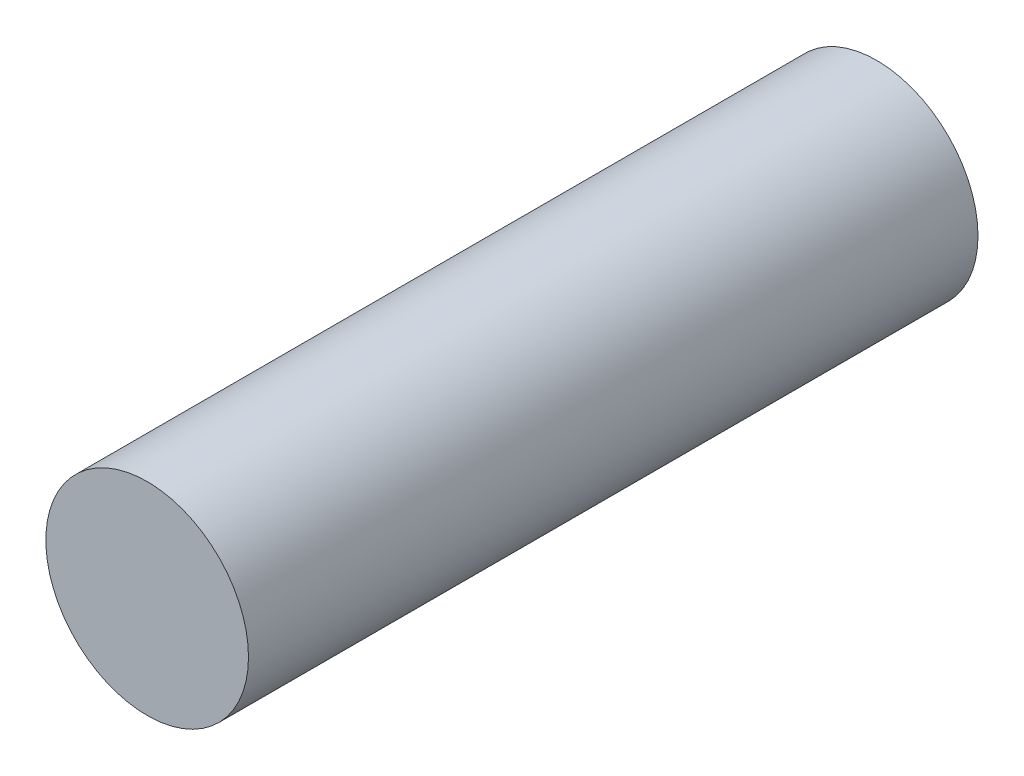
ISO-10303-21;
HEADER;
FILE_DESCRIPTION(('STEP AP214'),'2;1');
FILE_NAME('part.step','',(''),(''),'','','');
FILE_SCHEMA(('AUTOMOTIVE_DESIGN { 1 0 10303 214 1 1 1 1 }'));
ENDSEC;
DATA;
#1=APPLICATION_CONTEXT('core data for automotive mechanical design processes');
#2=APPLICATION_PROTOCOL_DEFINITION('international standard','automotive_design',2000,#1);
#3=PRODUCT_CONTEXT('',#1,'mechanical');
#4=PRODUCT('Part','Part','',(#3));
#5=PRODUCT_RELATED_PRODUCT_CATEGORY('part','',(#4));
#6=PRODUCT_DEFINITION_FORMATION('','',#4);
#7=PRODUCT_DEFINITION_CONTEXT('part definition',#1,'design');
#8=PRODUCT_DEFINITION('design','',#6,#7);
#9=PRODUCT_DEFINITION_SHAPE('','',#8);
#10=(LENGTH_UNIT() NAMED_UNIT(*) SI_UNIT(.MILLI.,.METRE.));
#11=(NAMED_UNIT(*) PLANE_ANGLE_UNIT() SI_UNIT($,.RADIAN.));
#12=(NAMED_UNIT(*) SI_UNIT($,.STERADIAN.) SOLID_ANGLE_UNIT());
#13=UNCERTAINTY_MEASURE_WITH_UNIT(LENGTH_MEASURE(1.E-05),#10,'distance_accuracy_value','');
#14=(GEOMETRIC_REPRESENTATION_CONTEXT(3) GLOBAL_UNCERTAINTY_ASSIGNED_CONTEXT((#13)) GLOBAL_UNIT_ASSIGNED_CONTEXT((#10,
#11,#12)) REPRESENTATION_CONTEXT('',''));
#15=CARTESIAN_POINT('',(0.,0.,0.));
#16=DIRECTION('',(0.,0.,1.));
#17=DIRECTION('',(1.,0.,0.));
#18=AXIS2_PLACEMENT_3D('',#15,#16,#17);
#19=CARTESIAN_POINT('',(0.,0.,9.));
#20=DIRECTION('',(0.,0.,-1.));
#21=DIRECTION('',(-1.,0.,0.));
#22=AXIS2_PLACEMENT_3D('',#19,#20,#21);
#23=CYLINDRICAL_SURFACE('',#22,1.25);
#24=CARTESIAN_POINT('',(0.,0.,9.));
#25=DIRECTION('',(0.,0.,1.));
#26=DIRECTION('',(1.,0.,0.));
#27=AXIS2_PLACEMENT_3D('',#24,#25,#26);
#28=CIRCLE('',#27,1.25);
#29=CARTESIAN_POINT('',(1.25,0.,9.));
#30=VERTEX_POINT('',#29);
#31=EDGE_CURVE('E10',#30,#30,#28,.T.);
#32=ORIENTED_EDGE('',*,*,#31,.F.);
#33=EDGE_LOOP('',(#32));
#34=FACE_BOUND('',#33,.T.);
#35=CARTESIAN_POINT('',(0.,0.,0.));
#36=DIRECTION('',(0.,0.,1.));
#37=DIRECTION('',(1.,0.,0.));
#38=AXIS2_PLACEMENT_3D('',#35,#36,#37);
#39=CIRCLE('',#38,1.25);
#40=CARTESIAN_POINT('',(1.25,0.,0.));
#41=VERTEX_POINT('',#40);
#42=EDGE_CURVE('E33',#41,#41,#39,.T.);
#43=ORIENTED_EDGE('',*,*,#42,.T.);
#44=EDGE_LOOP('',(#43));
#45=FACE_BOUND('',#44,.T.);
#46=ADVANCED_FACE('F30',(#34,#45),#23,.T.);
#47=CARTESIAN_POINT('',(0.,0.,9.));
#48=DIRECTION('',(0.,0.,1.));
#49=DIRECTION('',(1.,0.,0.));
#50=AXIS2_PLACEMENT_3D('',#47,#48,#49);
#51=PLANE('',#50);
#52=ORIENTED_EDGE('',*,*,#31,.T.);
#53=EDGE_LOOP('',(#52));
#54=FACE_BOUND('',#53,.T.);
#55=ADVANCED_FACE('F45',(#54),#51,.T.);
#56=CARTESIAN_POINT('',(0.,0.,0.));
#57=DIRECTION('',(0.,0.,1.));
#58=DIRECTION('',(1.,0.,0.));
#59=AXIS2_PLACEMENT_3D('',#56,#57,#58);
#60=PLANE('',#59);
#61=ORIENTED_EDGE('',*,*,#42,.F.);
#62=EDGE_LOOP('',(#61));
#63=FACE_BOUND('',#62,.T.);
#64=ADVANCED_FACE('F43',(#63),#60,.F.);
#65=CLOSED_SHELL('',(#46,#55,#64));
#66=MANIFOLD_SOLID_BREP('B2',#65);
#67=ADVANCED_BREP_SHAPE_REPRESENTATION('',(#18,#66),#14);
#68=SHAPE_DEFINITION_REPRESENTATION(#9,#67);
ENDSEC;
END-ISO-10303-21;
